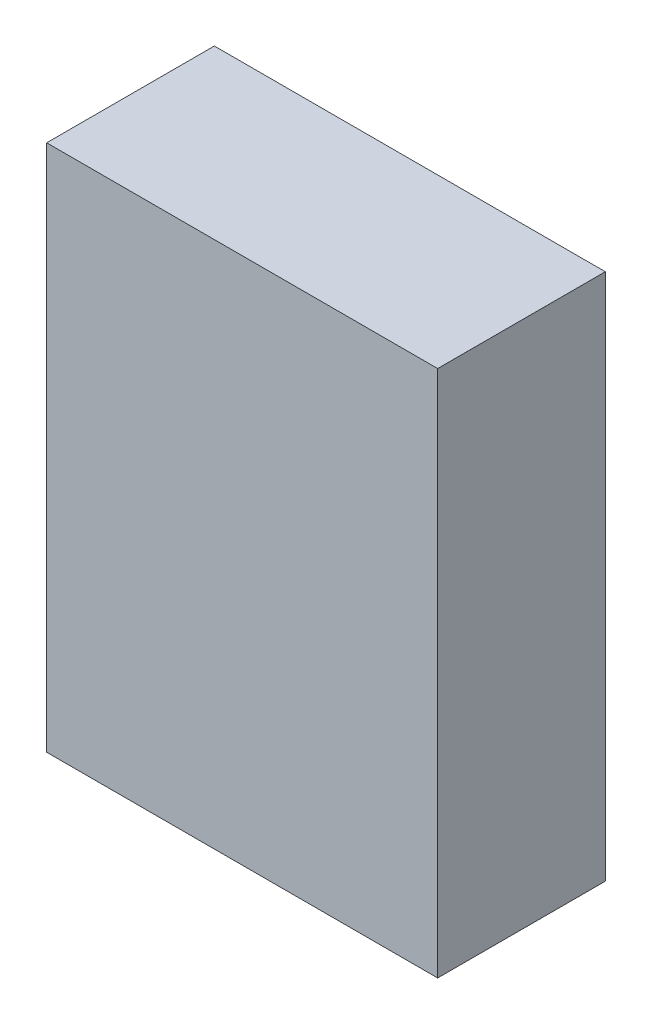
ISO-10303-21;
HEADER;
FILE_DESCRIPTION(('STEP AP214'),'2;1');
FILE_NAME('part.step','',(''),(''),'','','');
FILE_SCHEMA(('AUTOMOTIVE_DESIGN { 1 0 10303 214 1 1 1 1 }'));
ENDSEC;
DATA;
#1=APPLICATION_CONTEXT('core data for automotive mechanical design processes');
#2=APPLICATION_PROTOCOL_DEFINITION('international standard','automotive_design',2000,#1);
#3=PRODUCT_CONTEXT('',#1,'mechanical');
#4=PRODUCT('Part','Part','',(#3));
#5=PRODUCT_RELATED_PRODUCT_CATEGORY('part','',(#4));
#6=PRODUCT_DEFINITION_FORMATION('','',#4);
#7=PRODUCT_DEFINITION_CONTEXT('part definition',#1,'design');
#8=PRODUCT_DEFINITION('design','',#6,#7);
#9=PRODUCT_DEFINITION_SHAPE('','',#8);
#10=(LENGTH_UNIT() NAMED_UNIT(*) SI_UNIT(.MILLI.,.METRE.));
#11=(NAMED_UNIT(*) PLANE_ANGLE_UNIT() SI_UNIT($,.RADIAN.));
#12=(NAMED_UNIT(*) SI_UNIT($,.STERADIAN.) SOLID_ANGLE_UNIT());
#13=UNCERTAINTY_MEASURE_WITH_UNIT(LENGTH_MEASURE(1.E-05),#10,'distance_accuracy_value','');
#14=(GEOMETRIC_REPRESENTATION_CONTEXT(3) GLOBAL_UNCERTAINTY_ASSIGNED_CONTEXT((#13)) GLOBAL_UNIT_ASSIGNED_CONTEXT((#10,
#11,#12)) REPRESENTATION_CONTEXT('',''));
#15=CARTESIAN_POINT('',(0.,0.,0.));
#16=DIRECTION('',(0.,0.,1.));
#17=DIRECTION('',(1.,0.,0.));
#18=AXIS2_PLACEMENT_3D('',#15,#16,#17);
#19=CARTESIAN_POINT('',(-0.87448898,1.18051072,0.));
#20=DIRECTION('',(0.,1.,0.));
#21=DIRECTION('',(1.,0.,0.));
#22=AXIS2_PLACEMENT_3D('',#19,#20,#21);
#23=PLANE('',#22);
#24=DIRECTION('',(0.,0.,1.));
#25=VECTOR('',#24,1.);
#26=CARTESIAN_POINT('',(-0.87448898,1.18051072,0.));
#27=LINE('',#26,#25);
#28=CARTESIAN_POINT('',(-0.87448898,1.18051072,0.));
#29=VERTEX_POINT('',#28);
#30=CARTESIAN_POINT('',(-0.87448898,1.18051072,0.75000104));
#31=VERTEX_POINT('',#30);
#32=EDGE_CURVE('E11',#29,#31,#27,.T.);
#33=ORIENTED_EDGE('',*,*,#32,.T.);
#34=DIRECTION('',(1.,0.,0.));
#35=VECTOR('',#34,1.);
#36=CARTESIAN_POINT('',(-0.87448898,1.18051072,0.75000104));
#37=LINE('',#36,#35);
#38=CARTESIAN_POINT('',(0.87449152,1.18051072,0.75000104));
#39=VERTEX_POINT('',#38);
#40=EDGE_CURVE('E24',#31,#39,#37,.T.);
#41=ORIENTED_EDGE('',*,*,#40,.T.);
#42=DIRECTION('',(0.,0.,1.));
#43=VECTOR('',#42,1.);
#44=CARTESIAN_POINT('',(0.87449152,1.18051072,0.));
#45=LINE('',#44,#43);
#46=CARTESIAN_POINT('',(0.87449152,1.18051072,0.));
#47=VERTEX_POINT('',#46);
#48=EDGE_CURVE('E85',#47,#39,#45,.T.);
#49=ORIENTED_EDGE('',*,*,#48,.F.);
#50=DIRECTION('',(1.,0.,0.));
#51=VECTOR('',#50,1.);
#52=CARTESIAN_POINT('',(-0.87448898,1.18051072,0.));
#53=LINE('',#52,#51);
#54=EDGE_CURVE('E83',#29,#47,#53,.T.);
#55=ORIENTED_EDGE('',*,*,#54,.F.);
#56=EDGE_LOOP('',(#33,#41,#49,#55));
#57=FACE_BOUND('',#56,.T.);
#58=ADVANCED_FACE('F17',(#57),#23,.T.);
#59=CARTESIAN_POINT('',(0.87449152,1.18051072,0.));
#60=DIRECTION('',(1.,0.,0.));
#61=DIRECTION('',(0.,-1.,0.));
#62=AXIS2_PLACEMENT_3D('',#59,#60,#61);
#63=PLANE('',#62);
#64=ORIENTED_EDGE('',*,*,#48,.T.);
#65=DIRECTION('',(0.,-1.,0.));
#66=VECTOR('',#65,1.);
#67=CARTESIAN_POINT('',(0.87449152,1.18051072,0.75000104));
#68=LINE('',#67,#66);
#69=CARTESIAN_POINT('',(0.87449152,-1.18050818,0.75000104));
#70=VERTEX_POINT('',#69);
#71=EDGE_CURVE('E81',#39,#70,#68,.T.);
#72=ORIENTED_EDGE('',*,*,#71,.T.);
#73=DIRECTION('',(0.,0.,1.));
#74=VECTOR('',#73,1.);
#75=CARTESIAN_POINT('',(0.87449152,-1.18050818,0.));
#76=LINE('',#75,#74);
#77=CARTESIAN_POINT('',(0.87449152,-1.18050818,0.));
#78=VERTEX_POINT('',#77);
#79=EDGE_CURVE('E79',#78,#70,#76,.T.);
#80=ORIENTED_EDGE('',*,*,#79,.F.);
#81=DIRECTION('',(0.,-1.,0.));
#82=VECTOR('',#81,1.);
#83=CARTESIAN_POINT('',(0.87449152,1.18051072,0.));
#84=LINE('',#83,#82);
#85=EDGE_CURVE('E70',#47,#78,#84,.T.);
#86=ORIENTED_EDGE('',*,*,#85,.F.);
#87=EDGE_LOOP('',(#64,#72,#80,#86));
#88=FACE_BOUND('',#87,.T.);
#89=ADVANCED_FACE('F90',(#88),#63,.T.);
#90=CARTESIAN_POINT('',(0.87449152,-1.18050818,0.));
#91=DIRECTION('',(-1.45227462341292E-06,-0.999999999998946,0.));
#92=DIRECTION('',(-0.999999999998946,1.45227462341292E-06,0.));
#93=AXIS2_PLACEMENT_3D('',#90,#91,#92);
#94=PLANE('',#93);
#95=ORIENTED_EDGE('',*,*,#79,.T.);
#96=DIRECTION('',(-0.999999999998946,1.45227462341292E-06,0.));
#97=VECTOR('',#96,1.);
#98=CARTESIAN_POINT('',(0.87449152,-1.18050818,0.75000104));
#99=LINE('',#98,#97);
#100=CARTESIAN_POINT('',(-0.87448898,-1.18050564,0.75000104));
#101=VERTEX_POINT('',#100);
#102=EDGE_CURVE('E60',#70,#101,#99,.T.);
#103=ORIENTED_EDGE('',*,*,#102,.T.);
#104=DIRECTION('',(0.,0.,1.));
#105=VECTOR('',#104,1.);
#106=CARTESIAN_POINT('',(-0.87448898,-1.18050564,0.));
#107=LINE('',#106,#105);
#108=CARTESIAN_POINT('',(-0.87448898,-1.18050564,0.));
#109=VERTEX_POINT('',#108);
#110=EDGE_CURVE('E54',#109,#101,#107,.T.);
#111=ORIENTED_EDGE('',*,*,#110,.F.);
#112=DIRECTION('',(-0.999999999998946,1.45227462341292E-06,0.));
#113=VECTOR('',#112,1.);
#114=CARTESIAN_POINT('',(0.87449152,-1.18050818,0.));
#115=LINE('',#114,#113);
#116=EDGE_CURVE('E58',#78,#109,#115,.T.);
#117=ORIENTED_EDGE('',*,*,#116,.F.);
#118=EDGE_LOOP('',(#95,#103,#111,#117));
#119=FACE_BOUND('',#118,.T.);
#120=ADVANCED_FACE('F57',(#119),#94,.T.);
#121=CARTESIAN_POINT('',(-0.87448898,-1.18050564,0.));
#122=DIRECTION('',(-1.,0.,0.));
#123=DIRECTION('',(0.,1.,0.));
#124=AXIS2_PLACEMENT_3D('',#121,#122,#123);
#125=PLANE('',#124);
#126=ORIENTED_EDGE('',*,*,#110,.T.);
#127=DIRECTION('',(0.,1.,0.));
#128=VECTOR('',#127,1.);
#129=CARTESIAN_POINT('',(-0.87448898,-1.18050564,0.75000104));
#130=LINE('',#129,#128);
#131=EDGE_CURVE('E71',#101,#31,#130,.T.);
#132=ORIENTED_EDGE('',*,*,#131,.T.);
#133=ORIENTED_EDGE('',*,*,#32,.F.);
#134=DIRECTION('',(0.,1.,0.));
#135=VECTOR('',#134,1.);
#136=CARTESIAN_POINT('',(-0.87448898,-1.18050564,0.));
#137=LINE('',#136,#135);
#138=EDGE_CURVE('E68',#109,#29,#137,.T.);
#139=ORIENTED_EDGE('',*,*,#138,.F.);
#140=EDGE_LOOP('',(#126,#132,#133,#139));
#141=FACE_BOUND('',#140,.T.);
#142=ADVANCED_FACE('F73',(#141),#125,.T.);
#143=CARTESIAN_POINT('',(-0.87448898,1.18051072,0.));
#144=DIRECTION('',(0.,0.,1.));
#145=DIRECTION('',(1.,0.,0.));
#146=AXIS2_PLACEMENT_3D('',#143,#144,#145);
#147=PLANE('',#146);
#148=ORIENTED_EDGE('',*,*,#54,.T.);
#149=ORIENTED_EDGE('',*,*,#85,.T.);
#150=ORIENTED_EDGE('',*,*,#116,.T.);
#151=ORIENTED_EDGE('',*,*,#138,.T.);
#152=EDGE_LOOP('',(#148,#149,#150,#151));
#153=FACE_BOUND('',#152,.T.);
#154=ADVANCED_FACE('F67',(#153),#147,.F.);
#155=CARTESIAN_POINT('',(-0.87448898,1.18051072,0.75000104));
#156=DIRECTION('',(0.,0.,1.));
#157=DIRECTION('',(1.,0.,0.));
#158=AXIS2_PLACEMENT_3D('',#155,#156,#157);
#159=PLANE('',#158);
#160=ORIENTED_EDGE('',*,*,#131,.F.);
#161=ORIENTED_EDGE('',*,*,#102,.F.);
#162=ORIENTED_EDGE('',*,*,#71,.F.);
#163=ORIENTED_EDGE('',*,*,#40,.F.);
#164=EDGE_LOOP('',(#160,#161,#162,#163));
#165=FACE_BOUND('',#164,.T.);
#166=ADVANCED_FACE('F91',(#165),#159,.T.);
#167=CLOSED_SHELL('',(#58,#89,#120,#142,#154,#166));
#168=MANIFOLD_SOLID_BREP('B1',#167);
#169=ADVANCED_BREP_SHAPE_REPRESENTATION('',(#18,#168),#14);
#170=SHAPE_DEFINITION_REPRESENTATION(#9,#169);
ENDSEC;
END-ISO-10303-21;
